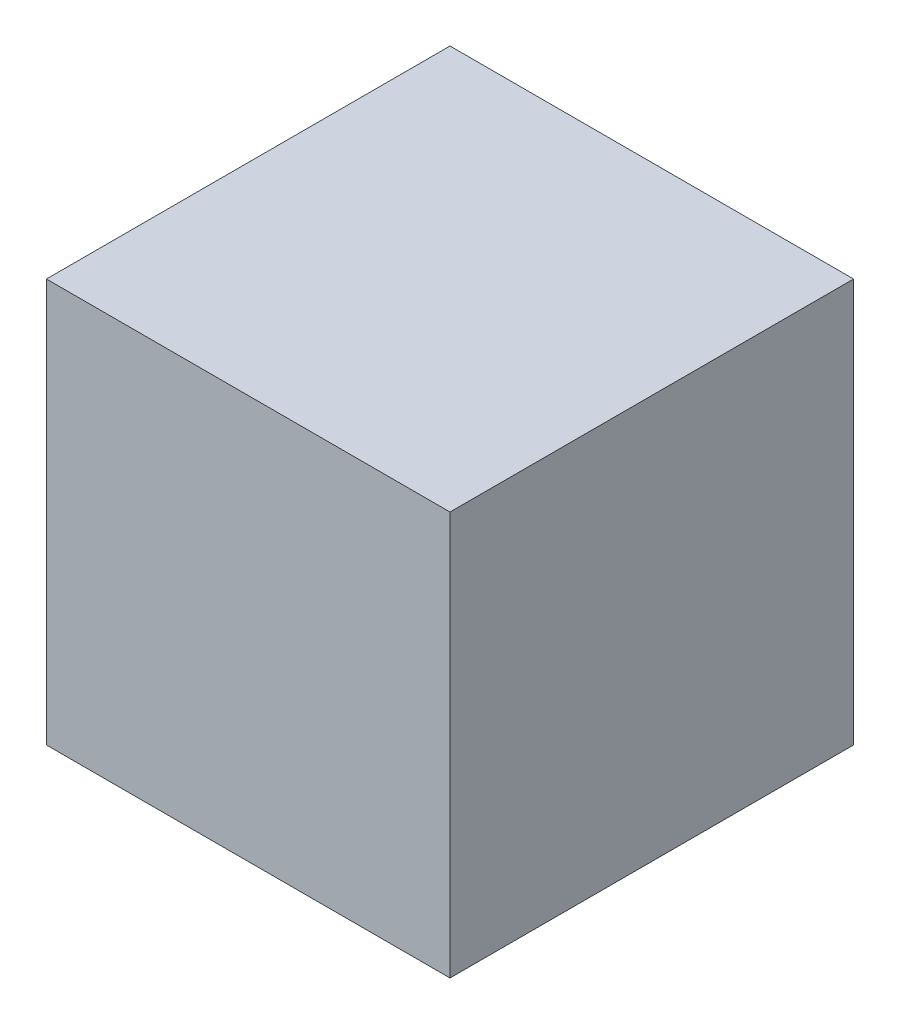
ISO-10303-21;
HEADER;
FILE_DESCRIPTION(('STEP AP214'),'2;1');
FILE_NAME('part.step','',(''),(''),'','','');
FILE_SCHEMA(('AUTOMOTIVE_DESIGN { 1 0 10303 214 1 1 1 1 }'));
ENDSEC;
DATA;
#1=APPLICATION_CONTEXT('core data for automotive mechanical design processes');
#2=APPLICATION_PROTOCOL_DEFINITION('international standard','automotive_design',2000,#1);
#3=PRODUCT_CONTEXT('',#1,'mechanical');
#4=PRODUCT('Part','Part','',(#3));
#5=PRODUCT_RELATED_PRODUCT_CATEGORY('part','',(#4));
#6=PRODUCT_DEFINITION_FORMATION('','',#4);
#7=PRODUCT_DEFINITION_CONTEXT('part definition',#1,'design');
#8=PRODUCT_DEFINITION('design','',#6,#7);
#9=PRODUCT_DEFINITION_SHAPE('','',#8);
#10=(LENGTH_UNIT() NAMED_UNIT(*) SI_UNIT(.MILLI.,.METRE.));
#11=(NAMED_UNIT(*) PLANE_ANGLE_UNIT() SI_UNIT($,.RADIAN.));
#12=(NAMED_UNIT(*) SI_UNIT($,.STERADIAN.) SOLID_ANGLE_UNIT());
#13=UNCERTAINTY_MEASURE_WITH_UNIT(LENGTH_MEASURE(1.E-05),#10,'distance_accuracy_value','');
#14=(GEOMETRIC_REPRESENTATION_CONTEXT(3) GLOBAL_UNCERTAINTY_ASSIGNED_CONTEXT((#13)) GLOBAL_UNIT_ASSIGNED_CONTEXT((#10,
#11,#12)) REPRESENTATION_CONTEXT('',''));
#15=CARTESIAN_POINT('',(0.,0.,0.));
#16=DIRECTION('',(0.,0.,1.));
#17=DIRECTION('',(1.,0.,0.));
#18=AXIS2_PLACEMENT_3D('',#15,#16,#17);
#19=CARTESIAN_POINT('',(50.,100.,50.));
#20=DIRECTION('',(-1.,0.,0.));
#21=DIRECTION('',(0.,0.,1.));
#22=AXIS2_PLACEMENT_3D('',#19,#20,#21);
#23=PLANE('',#22);
#24=DIRECTION('',(0.,0.,-1.));
#25=VECTOR('',#24,1.);
#26=CARTESIAN_POINT('',(50.,0.,50.));
#27=LINE('',#26,#25);
#28=CARTESIAN_POINT('',(50.,0.,50.));
#29=VERTEX_POINT('',#28);
#30=CARTESIAN_POINT('',(50.,0.,-50.));
#31=VERTEX_POINT('',#30);
#32=EDGE_CURVE('E107',#29,#31,#27,.T.);
#33=ORIENTED_EDGE('',*,*,#32,.T.);
#34=DIRECTION('',(0.,-1.,0.));
#35=VECTOR('',#34,1.);
#36=CARTESIAN_POINT('',(50.,100.,-50.));
#37=LINE('',#36,#35);
#38=CARTESIAN_POINT('',(50.,100.,-50.));
#39=VERTEX_POINT('',#38);
#40=EDGE_CURVE('E11',#39,#31,#37,.T.);
#41=ORIENTED_EDGE('',*,*,#40,.F.);
#42=DIRECTION('',(0.,0.,-1.));
#43=VECTOR('',#42,1.);
#44=CARTESIAN_POINT('',(50.,100.,50.));
#45=LINE('',#44,#43);
#46=CARTESIAN_POINT('',(50.,100.,50.));
#47=VERTEX_POINT('',#46);
#48=EDGE_CURVE('E89',#47,#39,#45,.T.);
#49=ORIENTED_EDGE('',*,*,#48,.F.);
#50=DIRECTION('',(0.,-1.,0.));
#51=VECTOR('',#50,1.);
#52=CARTESIAN_POINT('',(50.,100.,50.));
#53=LINE('',#52,#51);
#54=EDGE_CURVE('E56',#47,#29,#53,.T.);
#55=ORIENTED_EDGE('',*,*,#54,.T.);
#56=EDGE_LOOP('',(#33,#41,#49,#55));
#57=FACE_BOUND('',#56,.T.);
#58=ADVANCED_FACE('F39',(#57),#23,.F.);
#59=CARTESIAN_POINT('',(50.,100.,-50.));
#60=DIRECTION('',(0.,0.,1.));
#61=DIRECTION('',(1.,0.,0.));
#62=AXIS2_PLACEMENT_3D('',#59,#60,#61);
#63=PLANE('',#62);
#64=DIRECTION('',(-1.,0.,0.));
#65=VECTOR('',#64,1.);
#66=CARTESIAN_POINT('',(50.,0.,-50.));
#67=LINE('',#66,#65);
#68=CARTESIAN_POINT('',(-50.,0.,-50.));
#69=VERTEX_POINT('',#68);
#70=EDGE_CURVE('E95',#31,#69,#67,.T.);
#71=ORIENTED_EDGE('',*,*,#70,.T.);
#72=DIRECTION('',(0.,-1.,0.));
#73=VECTOR('',#72,1.);
#74=CARTESIAN_POINT('',(-50.,100.,-50.));
#75=LINE('',#74,#73);
#76=CARTESIAN_POINT('',(-50.,100.,-50.));
#77=VERTEX_POINT('',#76);
#78=EDGE_CURVE('E48',#77,#69,#75,.T.);
#79=ORIENTED_EDGE('',*,*,#78,.F.);
#80=DIRECTION('',(-1.,0.,0.));
#81=VECTOR('',#80,1.);
#82=CARTESIAN_POINT('',(50.,100.,-50.));
#83=LINE('',#82,#81);
#84=EDGE_CURVE('E81',#39,#77,#83,.T.);
#85=ORIENTED_EDGE('',*,*,#84,.F.);
#86=ORIENTED_EDGE('',*,*,#40,.T.);
#87=EDGE_LOOP('',(#71,#79,#85,#86));
#88=FACE_BOUND('',#87,.T.);
#89=ADVANCED_FACE('F94',(#88),#63,.F.);
#90=CARTESIAN_POINT('',(-50.,100.,50.));
#91=DIRECTION('',(-1.,0.,0.));
#92=DIRECTION('',(0.,0.,1.));
#93=AXIS2_PLACEMENT_3D('',#90,#91,#92);
#94=PLANE('',#93);
#95=DIRECTION('',(0.,0.,-1.));
#96=VECTOR('',#95,1.);
#97=CARTESIAN_POINT('',(-50.,0.,50.));
#98=LINE('',#97,#96);
#99=CARTESIAN_POINT('',(-50.,0.,50.));
#100=VERTEX_POINT('',#99);
#101=EDGE_CURVE('E112',#100,#69,#98,.T.);
#102=ORIENTED_EDGE('',*,*,#101,.F.);
#103=DIRECTION('',(0.,-1.,0.));
#104=VECTOR('',#103,1.);
#105=CARTESIAN_POINT('',(-50.,100.,50.));
#106=LINE('',#105,#104);
#107=CARTESIAN_POINT('',(-50.,100.,50.));
#108=VERTEX_POINT('',#107);
#109=EDGE_CURVE('E70',#108,#100,#106,.T.);
#110=ORIENTED_EDGE('',*,*,#109,.F.);
#111=DIRECTION('',(0.,0.,-1.));
#112=VECTOR('',#111,1.);
#113=CARTESIAN_POINT('',(-50.,100.,50.));
#114=LINE('',#113,#112);
#115=EDGE_CURVE('E88',#108,#77,#114,.T.);
#116=ORIENTED_EDGE('',*,*,#115,.T.);
#117=ORIENTED_EDGE('',*,*,#78,.T.);
#118=EDGE_LOOP('',(#102,#110,#116,#117));
#119=FACE_BOUND('',#118,.T.);
#120=ADVANCED_FACE('F99',(#119),#94,.T.);
#121=CARTESIAN_POINT('',(50.,100.,50.));
#122=DIRECTION('',(0.,0.,1.));
#123=DIRECTION('',(1.,0.,0.));
#124=AXIS2_PLACEMENT_3D('',#121,#122,#123);
#125=PLANE('',#124);
#126=DIRECTION('',(-1.,0.,0.));
#127=VECTOR('',#126,1.);
#128=CARTESIAN_POINT('',(50.,0.,50.));
#129=LINE('',#128,#127);
#130=EDGE_CURVE('E115',#29,#100,#129,.T.);
#131=ORIENTED_EDGE('',*,*,#130,.F.);
#132=ORIENTED_EDGE('',*,*,#54,.F.);
#133=DIRECTION('',(-1.,0.,0.));
#134=VECTOR('',#133,1.);
#135=CARTESIAN_POINT('',(50.,100.,50.));
#136=LINE('',#135,#134);
#137=EDGE_CURVE('E101',#47,#108,#136,.T.);
#138=ORIENTED_EDGE('',*,*,#137,.T.);
#139=ORIENTED_EDGE('',*,*,#109,.T.);
#140=EDGE_LOOP('',(#131,#132,#138,#139));
#141=FACE_BOUND('',#140,.T.);
#142=ADVANCED_FACE('F125',(#141),#125,.T.);
#143=CARTESIAN_POINT('',(0.,100.,0.));
#144=DIRECTION('',(0.,1.,0.));
#145=DIRECTION('',(0.,0.,1.));
#146=AXIS2_PLACEMENT_3D('',#143,#144,#145);
#147=PLANE('',#146);
#148=ORIENTED_EDGE('',*,*,#48,.T.);
#149=ORIENTED_EDGE('',*,*,#84,.T.);
#150=ORIENTED_EDGE('',*,*,#115,.F.);
#151=ORIENTED_EDGE('',*,*,#137,.F.);
#152=EDGE_LOOP('',(#148,#149,#150,#151));
#153=FACE_BOUND('',#152,.T.);
#154=ADVANCED_FACE('F85',(#153),#147,.T.);
#155=CARTESIAN_POINT('',(0.,0.,0.));
#156=DIRECTION('',(0.,1.,0.));
#157=DIRECTION('',(0.,0.,1.));
#158=AXIS2_PLACEMENT_3D('',#155,#156,#157);
#159=PLANE('',#158);
#160=ORIENTED_EDGE('',*,*,#32,.F.);
#161=ORIENTED_EDGE('',*,*,#130,.T.);
#162=ORIENTED_EDGE('',*,*,#101,.T.);
#163=ORIENTED_EDGE('',*,*,#70,.F.);
#164=EDGE_LOOP('',(#160,#161,#162,#163));
#165=FACE_BOUND('',#164,.T.);
#166=ADVANCED_FACE('F124',(#165),#159,.F.);
#167=CLOSED_SHELL('',(#58,#89,#120,#142,#154,#166));
#168=MANIFOLD_SOLID_BREP('B2',#167);
#169=ADVANCED_BREP_SHAPE_REPRESENTATION('',(#18,#168),#14);
#170=SHAPE_DEFINITION_REPRESENTATION(#9,#169);
ENDSEC;
END-ISO-10303-21;
